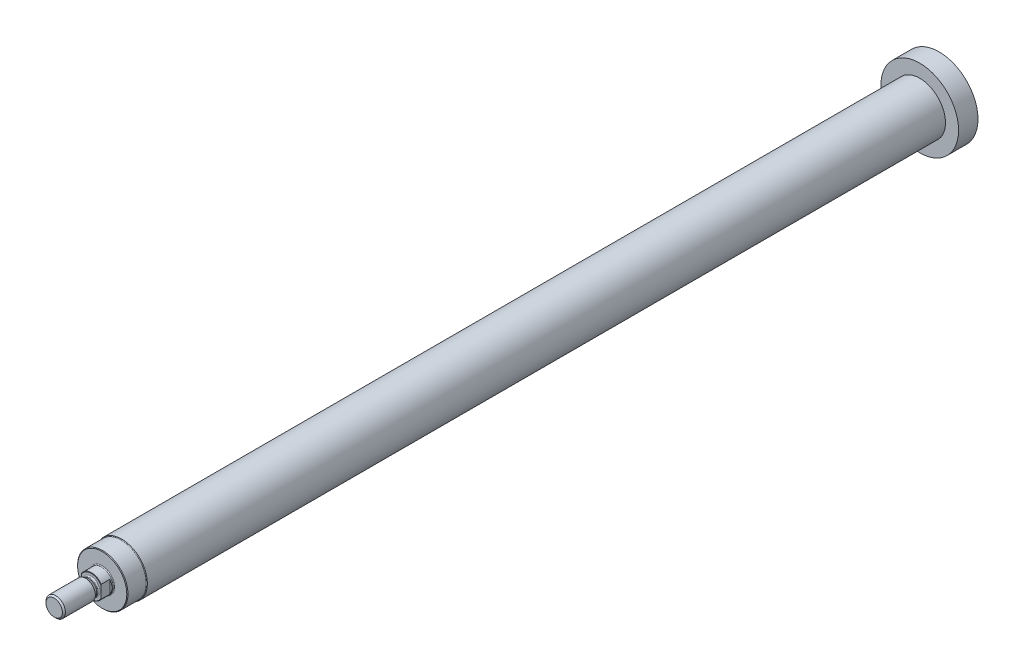
ISO-10303-21;
HEADER;
FILE_DESCRIPTION(('STEP AP214'),'2;1');
FILE_NAME('part.step','',(''),(''),'','','');
FILE_SCHEMA(('AUTOMOTIVE_DESIGN { 1 0 10303 214 1 1 1 1 }'));
ENDSEC;
DATA;
#1=APPLICATION_CONTEXT('core data for automotive mechanical design processes');
#2=APPLICATION_PROTOCOL_DEFINITION('international standard','automotive_design',2000,#1);
#3=PRODUCT_CONTEXT('',#1,'mechanical');
#4=PRODUCT('Part','Part','',(#3));
#5=PRODUCT_RELATED_PRODUCT_CATEGORY('part','',(#4));
#6=PRODUCT_DEFINITION_FORMATION('','',#4);
#7=PRODUCT_DEFINITION_CONTEXT('part definition',#1,'design');
#8=PRODUCT_DEFINITION('design','',#6,#7);
#9=PRODUCT_DEFINITION_SHAPE('','',#8);
#10=(LENGTH_UNIT() NAMED_UNIT(*) SI_UNIT(.MILLI.,.METRE.));
#11=(NAMED_UNIT(*) PLANE_ANGLE_UNIT() SI_UNIT($,.RADIAN.));
#12=(NAMED_UNIT(*) SI_UNIT($,.STERADIAN.) SOLID_ANGLE_UNIT());
#13=UNCERTAINTY_MEASURE_WITH_UNIT(LENGTH_MEASURE(1.E-05),#10,'distance_accuracy_value','');
#14=(GEOMETRIC_REPRESENTATION_CONTEXT(3) GLOBAL_UNCERTAINTY_ASSIGNED_CONTEXT((#13)) GLOBAL_UNIT_ASSIGNED_CONTEXT((#10,
#11,#12)) REPRESENTATION_CONTEXT('',''));
#15=CARTESIAN_POINT('',(0.,0.,0.));
#16=DIRECTION('',(0.,0.,1.));
#17=DIRECTION('',(1.,0.,0.));
#18=AXIS2_PLACEMENT_3D('',#15,#16,#17);
#19=CARTESIAN_POINT('',(0.,0.,21.3));
#20=DIRECTION('',(0.,0.,-1.));
#21=DIRECTION('',(-1.,0.,0.));
#22=AXIS2_PLACEMENT_3D('',#19,#20,#21);
#23=CONICAL_SURFACE('',#22,6.,0.785398163397366);
#24=CARTESIAN_POINT('',(0.,0.,21.3));
#25=DIRECTION('',(0.,0.,1.));
#26=DIRECTION('',(1.,0.,0.));
#27=AXIS2_PLACEMENT_3D('',#24,#25,#26);
#28=CIRCLE('',#27,6.);
#29=CARTESIAN_POINT('',(-5.,-3.3166247903554,21.3));
#30=VERTEX_POINT('',#29);
#31=CARTESIAN_POINT('',(5.,-3.3166247903554,21.3));
#32=VERTEX_POINT('',#31);
#33=EDGE_CURVE('E112',#30,#32,#28,.T.);
#34=ORIENTED_EDGE('',*,*,#33,.T.);
#35=CARTESIAN_POINT('',(5.,-12.2176789778879,14.0988000694348));
#36=CARTESIAN_POINT('',(5.,-12.034446447219,14.2683783577826));
#37=CARTESIAN_POINT('',(5.,-11.8509444650715,14.4376653764507));
#38=CARTESIAN_POINT('',(5.,-11.4833207545759,14.7755677293479));
#39=CARTESIAN_POINT('',(5.,-11.2991990217317,14.9441830586849));
#40=CARTESIAN_POINT('',(5.,-10.7457075833017,15.4489564643171));
#41=CARTESIAN_POINT('',(5.,-10.3752903859568,15.7839689371153));
#42=CARTESIAN_POINT('',(5.,-9.62858519125396,16.4518848263318));
#43=CARTESIAN_POINT('',(5.,-9.25227539434227,16.7847639083574));
#44=CARTESIAN_POINT('',(5.,-8.49470887355593,17.4447807567819));
#45=CARTESIAN_POINT('',(5.,-8.11345273493188,17.7719191918302));
#46=CARTESIAN_POINT('',(5.,-7.4205108180265,18.3537134313858));
#47=CARTESIAN_POINT('',(5.,-7.11006745508805,18.609846141451));
#48=CARTESIAN_POINT('',(5.,-6.48316002759758,19.114851393266));
#49=CARTESIAN_POINT('',(5.,-6.1666945388632,19.3637221814742));
#50=CARTESIAN_POINT('',(5.,-5.68610814885769,19.7289297443601));
#51=CARTESIAN_POINT('',(5.,-5.52501848317731,19.8492540406784));
#52=CARTESIAN_POINT('',(5.,-5.20045993673684,20.0866439636895));
#53=CARTESIAN_POINT('',(5.,-5.03699116742269,20.2037097422799));
#54=CARTESIAN_POINT('',(5.,-4.70731024174682,20.4337901252276));
#55=CARTESIAN_POINT('',(5.,-4.54109914963132,20.5468062495763));
#56=CARTESIAN_POINT('',(5.,-4.2053875486269,20.7678247468052));
#57=CARTESIAN_POINT('',(5.,-4.03588740968757,20.875827678983));
#58=CARTESIAN_POINT('',(5.,-3.69688196972469,21.083139411841));
#59=CARTESIAN_POINT('',(5.,-3.52746365424009,21.1825896827201));
#60=CARTESIAN_POINT('',(5.,-3.18429998418683,21.3738323133674));
#61=CARTESIAN_POINT('',(5.,-3.01055414798465,21.4656238157593));
#62=CARTESIAN_POINT('',(5.,-2.65829713178236,21.6393392193541));
#63=CARTESIAN_POINT('',(5.,-2.47978919748001,21.7212696417427));
#64=CARTESIAN_POINT('',(5.,-2.11750607525661,21.8725900809528));
#65=CARTESIAN_POINT('',(5.,-1.93373240265892,21.9419836643365));
#66=CARTESIAN_POINT('',(5.,-1.60179616287259,22.0514869260315));
#67=CARTESIAN_POINT('',(5.,-1.45465708540571,22.0946813849924));
#68=CARTESIAN_POINT('',(5.,-1.15750269842358,22.1697790194493));
#69=CARTESIAN_POINT('',(5.,-1.00748775290728,22.2016836140871));
#70=CARTESIAN_POINT('',(5.,-0.705757602496844,22.2526173317558));
#71=CARTESIAN_POINT('',(5.,-0.55404950239028,22.2716879366129));
#72=CARTESIAN_POINT('',(5.,-0.249521649238425,22.2960776864431));
#73=CARTESIAN_POINT('',(5.,-0.0967019582817359,22.3013975936443));
#74=CARTESIAN_POINT('',(5.,0.20917014680985,22.2979699797098));
#75=CARTESIAN_POINT('',(5.,0.362222149337708,22.2891862613037));
#76=CARTESIAN_POINT('',(5.,0.666920567730654,22.2579964853449));
#77=CARTESIAN_POINT('',(5.,0.818566870195592,22.2355893383119));
#78=CARTESIAN_POINT('',(5.,1.11992867397053,22.1782551235326));
#79=CARTESIAN_POINT('',(5.,1.26963669057649,22.1432892788203));
#80=CARTESIAN_POINT('',(5.,1.56603832051543,22.0624309113934));
#81=CARTESIAN_POINT('',(5.,1.71273180793289,22.0165379332612));
#82=CARTESIAN_POINT('',(5.,2.02036959338373,21.9093919078484));
#83=CARTESIAN_POINT('',(5.,2.18089769494565,21.8469536603318));
#84=CARTESIAN_POINT('',(5.,2.49794568206284,21.7125945673072));
#85=CARTESIAN_POINT('',(5.,2.65446432060577,21.6406708133978));
#86=CARTESIAN_POINT('',(5.,2.96400159958616,21.489056337277));
#87=CARTESIAN_POINT('',(5.,3.11701369544362,21.4093523541589));
#88=CARTESIAN_POINT('',(5.,3.41961980490705,21.2437828891095));
#89=CARTESIAN_POINT('',(5.,3.56921425448607,21.1579181989224));
#90=CARTESIAN_POINT('',(5.,3.86725925691391,20.9800941592023));
#91=CARTESIAN_POINT('',(5.,4.01567224290916,20.8880721285641));
#92=CARTESIAN_POINT('',(5.,4.30982445825237,20.6998605752006));
#93=CARTESIAN_POINT('',(5.,4.45556362577139,20.6036709562771));
#94=CARTESIAN_POINT('',(5.,4.88902870485944,20.310207181645));
#95=CARTESIAN_POINT('',(5.,5.17331083288786,20.1078496520423));
#96=CARTESIAN_POINT('',(5.,5.76162422896416,19.6741713699587));
#97=CARTESIAN_POINT('',(5.,6.06496587838009,19.441925426966));
#98=CARTESIAN_POINT('',(5.,6.66554264604083,18.9696266158592));
#99=CARTESIAN_POINT('',(5.,6.96277697331729,18.7295727467987));
#100=CARTESIAN_POINT('',(5.,7.55286026279438,18.2436372892536));
#101=CARTESIAN_POINT('',(5.,7.84570516434772,17.9977507898446));
#102=CARTESIAN_POINT('',(5.,8.42782440944073,17.5017841690976));
#103=CARTESIAN_POINT('',(5.,8.71709867293365,17.2517039540401));
#104=CARTESIAN_POINT('',(5.,9.27681202580929,16.7623601060657));
#105=CARTESIAN_POINT('',(5.,9.54740287839069,16.523269715136));
#106=CARTESIAN_POINT('',(5.,10.0865732582408,16.0428241642439));
#107=CARTESIAN_POINT('',(5.,10.3551527483599,15.8014689626352));
#108=CARTESIAN_POINT('',(5.,10.8901673773251,15.3173976040613));
#109=CARTESIAN_POINT('',(5.,11.1566055879447,15.0746848381281));
#110=CARTESIAN_POINT('',(5.,11.6881046905937,14.5877774388495));
#111=CARTESIAN_POINT('',(5.,11.9531656393767,14.3435828674791));
#112=CARTESIAN_POINT('',(5.,12.2176789778879,14.0988000694348));
#113=B_SPLINE_CURVE_WITH_KNOTS('',3,(#35,#36,#37,#38,#39,#40,#41,#42,#43,#44,#45,#46,#47,#48,
#49,#50,#51,#52,#53,#54,#55,#56,#57,#58,#59,#60,#61,#62,#63,#64,#65,#66,#67,#68,#69,#70,#71,#72,
#73,#74,#75,#76,#77,#78,#79,#80,#81,#82,#83,#84,#85,#86,#87,#88,#89,#90,#91,#92,#93,#94,#95,#96,
#97,#98,#99,#100,#101,#102,#103,#104,#105,#106,#107,#108,#109,#110,#111,#112),.UNSPECIFIED.,.F.,
.F.,(4,2,2,2,2,2,2,2,2,2,2,2,2,2,2,2,2,2,2,2,2,2,2,2,2,2,2,2,2,2,2,2,2,2,2,2,2,2,4),(0.,
0.748984328817224,1.49797410282567,2.9962758229022,4.50347404718252,6.01049553748492,
7.21782542751728,8.42544447951652,9.02861334938031,9.63175405496262,10.234665955304,
10.8375104292004,11.4267074421697,12.0159703257382,12.6048413601771,13.1935446040162,
13.6532123605347,14.1128223160341,14.5709394993219,15.0290312877301,15.4883006594101,
15.9476067641883,16.4083434158465,16.8690992733096,17.3854502138647,17.9019598452038,
18.4193657391731,18.9367052573438,19.4605002846108,19.9843074088003,21.0308380209063,
22.1767933392447,23.3228961482106,24.4700008351683,25.6171311914431,26.7003761988933,
27.7836411646704,28.8648794437871,29.946072808613),.UNSPECIFIED.);
#114=CARTESIAN_POINT('',(5.,-2.93938769133981,21.5));
#115=VERTEX_POINT('',#114);
#116=EDGE_CURVE('E165',#32,#115,#113,.T.);
#117=ORIENTED_EDGE('',*,*,#116,.T.);
#118=CARTESIAN_POINT('',(0.,0.,21.5));
#119=DIRECTION('',(0.,0.,1.));
#120=DIRECTION('',(1.,0.,0.));
#121=AXIS2_PLACEMENT_3D('',#118,#119,#120);
#122=CIRCLE('',#121,5.8);
#123=CARTESIAN_POINT('',(-5.,-2.93938769133981,21.5));
#124=VERTEX_POINT('',#123);
#125=EDGE_CURVE('E113',#124,#115,#122,.T.);
#126=ORIENTED_EDGE('',*,*,#125,.F.);
#127=CARTESIAN_POINT('',(-5.,12.2176789778879,14.0988000694348));
#128=CARTESIAN_POINT('',(-5.,12.034446447219,14.2683783577826));
#129=CARTESIAN_POINT('',(-5.,11.8509444650715,14.4376653764507));
#130=CARTESIAN_POINT('',(-5.,11.4833207545759,14.7755677293479));
#131=CARTESIAN_POINT('',(-5.,11.2991990217317,14.9441830586849));
#132=CARTESIAN_POINT('',(-5.,10.7457075833017,15.448956464317));
#133=CARTESIAN_POINT('',(-5.,10.3752903859568,15.7839689371153));
#134=CARTESIAN_POINT('',(-5.,9.62858519125396,16.4518848263318));
#135=CARTESIAN_POINT('',(-5.,9.25227539434227,16.7847639083574));
#136=CARTESIAN_POINT('',(-5.,8.49470887355593,17.4447807567819));
#137=CARTESIAN_POINT('',(-5.,8.11345273493188,17.7719191918302));
#138=CARTESIAN_POINT('',(-5.,7.4205108180265,18.3537134313858));
#139=CARTESIAN_POINT('',(-5.,7.11006745508806,18.609846141451));
#140=CARTESIAN_POINT('',(-5.,6.48316002759758,19.114851393266));
#141=CARTESIAN_POINT('',(-5.,6.16669453886321,19.3637221814742));
#142=CARTESIAN_POINT('',(-5.,5.68610814885769,19.7289297443601));
#143=CARTESIAN_POINT('',(-5.,5.52501848317732,19.8492540406784));
#144=CARTESIAN_POINT('',(-5.,5.20045993673684,20.0866439636895));
#145=CARTESIAN_POINT('',(-5.,5.03699116742269,20.2037097422799));
#146=CARTESIAN_POINT('',(-5.,4.70731024174682,20.4337901252276));
#147=CARTESIAN_POINT('',(-5.,4.54109914963132,20.5468062495763));
#148=CARTESIAN_POINT('',(-5.,4.2053875486269,20.7678247468052));
#149=CARTESIAN_POINT('',(-5.,4.03588740968757,20.875827678983));
#150=CARTESIAN_POINT('',(-5.,3.69688196972469,21.083139411841));
#151=CARTESIAN_POINT('',(-5.,3.52746365424009,21.1825896827201));
#152=CARTESIAN_POINT('',(-5.,3.18429998418683,21.3738323133674));
#153=CARTESIAN_POINT('',(-5.,3.01055414798464,21.4656238157593));
#154=CARTESIAN_POINT('',(-5.,2.65829713178236,21.6393392193541));
#155=CARTESIAN_POINT('',(-5.,2.47978919748001,21.7212696417427));
#156=CARTESIAN_POINT('',(-5.,2.11750607525661,21.8725900809528));
#157=CARTESIAN_POINT('',(-5.,1.93373240265892,21.9419836643365));
#158=CARTESIAN_POINT('',(-5.,1.60179616287259,22.0514869260315));
#159=CARTESIAN_POINT('',(-5.,1.45465708540571,22.0946813849924));
#160=CARTESIAN_POINT('',(-5.,1.15750269842358,22.1697790194493));
#161=CARTESIAN_POINT('',(-5.,1.00748775290727,22.2016836140871));
#162=CARTESIAN_POINT('',(-5.,0.705757602496841,22.2526173317558));
#163=CARTESIAN_POINT('',(-5.,0.554049502390278,22.2716879366129));
#164=CARTESIAN_POINT('',(-5.,0.249521649238424,22.2960776864431));
#165=CARTESIAN_POINT('',(-5.,0.0967019582817342,22.3013975936443));
#166=CARTESIAN_POINT('',(-5.,-0.209170146809852,22.2979699797098));
#167=CARTESIAN_POINT('',(-5.,-0.362222149337709,22.2891862613037));
#168=CARTESIAN_POINT('',(-5.,-0.666920567730654,22.2579964853449));
#169=CARTESIAN_POINT('',(-5.,-0.818566870195593,22.2355893383119));
#170=CARTESIAN_POINT('',(-5.,-1.11992867397053,22.1782551235326));
#171=CARTESIAN_POINT('',(-5.,-1.26963669057649,22.1432892788203));
#172=CARTESIAN_POINT('',(-5.,-1.56603832051543,22.0624309113934));
#173=CARTESIAN_POINT('',(-5.,-1.71273180793289,22.0165379332612));
#174=CARTESIAN_POINT('',(-5.,-2.02036959338373,21.9093919078484));
#175=CARTESIAN_POINT('',(-5.,-2.18089769494565,21.8469536603318));
#176=CARTESIAN_POINT('',(-5.,-2.49794568206284,21.7125945673072));
#177=CARTESIAN_POINT('',(-5.,-2.65446432060577,21.6406708133978));
#178=CARTESIAN_POINT('',(-5.,-2.96400159958616,21.489056337277));
#179=CARTESIAN_POINT('',(-5.,-3.11701369544362,21.4093523541589));
#180=CARTESIAN_POINT('',(-5.,-3.41961980490704,21.2437828891095));
#181=CARTESIAN_POINT('',(-5.,-3.56921425448607,21.1579181989224));
#182=CARTESIAN_POINT('',(-5.,-3.86725925691391,20.9800941592023));
#183=CARTESIAN_POINT('',(-5.,-4.01567224290916,20.8880721285641));
#184=CARTESIAN_POINT('',(-5.,-4.30982445825236,20.6998605752006));
#185=CARTESIAN_POINT('',(-5.,-4.45556362577139,20.6036709562771));
#186=CARTESIAN_POINT('',(-5.,-4.88902870485943,20.310207181645));
#187=CARTESIAN_POINT('',(-5.,-5.17331083288785,20.1078496520423));
#188=CARTESIAN_POINT('',(-5.,-5.76162422896415,19.6741713699587));
#189=CARTESIAN_POINT('',(-5.,-6.06496587838009,19.441925426966));
#190=CARTESIAN_POINT('',(-5.,-6.66554264604083,18.9696266158592));
#191=CARTESIAN_POINT('',(-5.,-6.96277697331728,18.7295727467988));
#192=CARTESIAN_POINT('',(-5.,-7.55286026279438,18.2436372892536));
#193=CARTESIAN_POINT('',(-5.,-7.84570516434772,17.9977507898446));
#194=CARTESIAN_POINT('',(-5.,-8.42782440944073,17.5017841690976));
#195=CARTESIAN_POINT('',(-5.,-8.71709867293365,17.2517039540401));
#196=CARTESIAN_POINT('',(-5.,-9.27681202580928,16.7623601060657));
#197=CARTESIAN_POINT('',(-5.,-9.54740287839069,16.523269715136));
#198=CARTESIAN_POINT('',(-5.,-10.0865732582408,16.0428241642439));
#199=CARTESIAN_POINT('',(-5.,-10.3551527483599,15.8014689626352));
#200=CARTESIAN_POINT('',(-5.,-10.8901673773251,15.3173976040613));
#201=CARTESIAN_POINT('',(-5.,-11.1566055879447,15.0746848381282));
#202=CARTESIAN_POINT('',(-5.,-11.6881046905937,14.5877774388495));
#203=CARTESIAN_POINT('',(-5.,-11.9531656393767,14.3435828674791));
#204=CARTESIAN_POINT('',(-5.,-12.2176789778879,14.0988000694348));
#205=B_SPLINE_CURVE_WITH_KNOTS('',3,(#127,#128,#129,#130,#131,#132,#133,#134,#135,#136,#137,
#138,#139,#140,#141,#142,#143,#144,#145,#146,#147,#148,#149,#150,#151,#152,#153,#154,#155,#156,
#157,#158,#159,#160,#161,#162,#163,#164,#165,#166,#167,#168,#169,#170,#171,#172,#173,#174,#175,
#176,#177,#178,#179,#180,#181,#182,#183,#184,#185,#186,#187,#188,#189,#190,#191,#192,#193,#194,
#195,#196,#197,#198,#199,#200,#201,#202,#203,#204),.UNSPECIFIED.,.F.,.F.,(4,2,2,2,2,2,2,2,2,2,2,
2,2,2,2,2,2,2,2,2,2,2,2,2,2,2,2,2,2,2,2,2,2,2,2,2,2,2,4),(0.,0.748984328817225,1.49797410282567,
2.9962758229022,4.50347404718253,6.01049553748492,7.21782542751727,8.42544447951651,
9.02861334938031,9.63175405496262,10.234665955304,10.8375104292004,11.4267074421697,
12.0159703257382,12.6048413601771,13.1935446040162,13.6532123605347,14.1128223160341,
14.5709394993219,15.0290312877301,15.4883006594101,15.9476067641883,16.4083434158465,
16.8690992733096,17.3854502138647,17.9019598452038,18.4193657391731,18.9367052573438,
19.4605002846108,19.9843074088002,21.0308380209062,22.1767933392447,23.3228961482106,
24.4700008351683,25.6171311914431,26.7003761988933,27.7836411646704,28.8648794437871,
29.946072808613),.UNSPECIFIED.);
#206=EDGE_CURVE('E54',#124,#30,#205,.T.);
#207=ORIENTED_EDGE('',*,*,#206,.T.);
#208=EDGE_LOOP('',(#34,#117,#126,#207));
#209=FACE_BOUND('',#208,.T.);
#210=ADVANCED_FACE('F39',(#209),#23,.T.);
#211=CARTESIAN_POINT('',(0.,20.,-415.));
#212=DIRECTION('',(0.,0.,1.));
#213=DIRECTION('',(1.,0.,0.));
#214=AXIS2_PLACEMENT_3D('',#211,#212,#213);
#215=PLANE('',#214);
#216=CARTESIAN_POINT('',(0.,0.,-415.));
#217=DIRECTION('',(0.,0.,1.));
#218=DIRECTION('',(1.,0.,0.));
#219=AXIS2_PLACEMENT_3D('',#216,#217,#218);
#220=CIRCLE('',#219,20.);
#221=CARTESIAN_POINT('',(20.,0.,-415.));
#222=VERTEX_POINT('',#221);
#223=EDGE_CURVE('E145',#222,#222,#220,.T.);
#224=ORIENTED_EDGE('',*,*,#223,.F.);
#225=EDGE_LOOP('',(#224));
#226=FACE_BOUND('',#225,.T.);
#227=ADVANCED_FACE('F41',(#226),#215,.F.);
#228=CARTESIAN_POINT('',(0.,0.,-415.));
#229=DIRECTION('',(0.,0.,1.));
#230=DIRECTION('',(1.,0.,0.));
#231=AXIS2_PLACEMENT_3D('',#228,#229,#230);
#232=CYLINDRICAL_SURFACE('',#231,20.);
#233=CARTESIAN_POINT('',(0.,0.,-405.));
#234=DIRECTION('',(0.,0.,1.));
#235=DIRECTION('',(1.,0.,0.));
#236=AXIS2_PLACEMENT_3D('',#233,#234,#235);
#237=CIRCLE('',#236,20.);
#238=CARTESIAN_POINT('',(20.,0.,-405.));
#239=VERTEX_POINT('',#238);
#240=EDGE_CURVE('E142',#239,#239,#237,.T.);
#241=ORIENTED_EDGE('',*,*,#240,.F.);
#242=EDGE_LOOP('',(#241));
#243=FACE_BOUND('',#242,.T.);
#244=ORIENTED_EDGE('',*,*,#223,.T.);
#245=EDGE_LOOP('',(#244));
#246=FACE_BOUND('',#245,.T.);
#247=ADVANCED_FACE('F214',(#243,#246),#232,.T.);
#248=CARTESIAN_POINT('',(0.,13.26,-405.));
#249=DIRECTION('',(0.,0.,-1.));
#250=DIRECTION('',(-1.,0.,0.));
#251=AXIS2_PLACEMENT_3D('',#248,#249,#250);
#252=PLANE('',#251);
#253=CARTESIAN_POINT('',(0.,0.,-405.));
#254=DIRECTION('',(0.,0.,1.));
#255=DIRECTION('',(1.,0.,0.));
#256=AXIS2_PLACEMENT_3D('',#253,#254,#255);
#257=CIRCLE('',#256,13.26);
#258=CARTESIAN_POINT('',(13.26,0.,-405.));
#259=VERTEX_POINT('',#258);
#260=EDGE_CURVE('E139',#259,#259,#257,.T.);
#261=ORIENTED_EDGE('',*,*,#260,.F.);
#262=EDGE_LOOP('',(#261));
#263=FACE_BOUND('',#262,.T.);
#264=ORIENTED_EDGE('',*,*,#240,.T.);
#265=EDGE_LOOP('',(#264));
#266=FACE_BOUND('',#265,.T.);
#267=ADVANCED_FACE('F311',(#263,#266),#252,.F.);
#268=CARTESIAN_POINT('',(0.,0.,-415.));
#269=DIRECTION('',(0.,0.,1.));
#270=DIRECTION('',(1.,0.,0.));
#271=AXIS2_PLACEMENT_3D('',#268,#269,#270);
#272=CYLINDRICAL_SURFACE('',#271,13.2599999999999);
#273=CARTESIAN_POINT('',(0.,0.,5.80000000000003));
#274=DIRECTION('',(0.,0.,1.));
#275=DIRECTION('',(1.,0.,0.));
#276=AXIS2_PLACEMENT_3D('',#273,#274,#275);
#277=CIRCLE('',#276,13.2599999999999);
#278=CARTESIAN_POINT('',(13.2599999999999,0.,5.80000000000003));
#279=VERTEX_POINT('',#278);
#280=EDGE_CURVE('E136',#279,#279,#277,.T.);
#281=ORIENTED_EDGE('',*,*,#280,.F.);
#282=EDGE_LOOP('',(#281));
#283=FACE_BOUND('',#282,.T.);
#284=ORIENTED_EDGE('',*,*,#260,.T.);
#285=EDGE_LOOP('',(#284));
#286=FACE_BOUND('',#285,.T.);
#287=ADVANCED_FACE('F341',(#283,#286),#272,.T.);
#288=CARTESIAN_POINT('',(0.,0.,6.09999999999988));
#289=DIRECTION('',(0.,0.,1.));
#290=DIRECTION('',(1.,0.,0.));
#291=AXIS2_PLACEMENT_3D('',#288,#289,#290);
#292=TOROIDAL_SURFACE('',#291,13.2599999999999,0.299999999999878);
#293=CARTESIAN_POINT('',(0.,0.,6.09999999999999));
#294=DIRECTION('',(0.,0.,1.));
#295=DIRECTION('',(1.,0.,0.));
#296=AXIS2_PLACEMENT_3D('',#293,#294,#295);
#297=CIRCLE('',#296,12.96);
#298=CARTESIAN_POINT('',(12.96,0.,6.09999999999999));
#299=VERTEX_POINT('',#298);
#300=EDGE_CURVE('E133',#299,#299,#297,.T.);
#301=ORIENTED_EDGE('',*,*,#300,.F.);
#302=EDGE_LOOP('',(#301));
#303=FACE_BOUND('',#302,.T.);
#304=ORIENTED_EDGE('',*,*,#280,.T.);
#305=EDGE_LOOP('',(#304));
#306=FACE_BOUND('',#305,.T.);
#307=ADVANCED_FACE('F346',(#303,#306),#292,.F.);
#308=CARTESIAN_POINT('',(0.,0.,-415.));
#309=DIRECTION('',(0.,0.,1.));
#310=DIRECTION('',(1.,0.,0.));
#311=AXIS2_PLACEMENT_3D('',#308,#309,#310);
#312=CYLINDRICAL_SURFACE('',#311,12.96);
#313=CARTESIAN_POINT('',(0.,0.,15.5));
#314=DIRECTION('',(0.,0.,1.));
#315=DIRECTION('',(1.,0.,0.));
#316=AXIS2_PLACEMENT_3D('',#313,#314,#315);
#317=CIRCLE('',#316,12.96);
#318=CARTESIAN_POINT('',(12.96,0.,15.5));
#319=VERTEX_POINT('',#318);
#320=EDGE_CURVE('E130',#319,#319,#317,.T.);
#321=ORIENTED_EDGE('',*,*,#320,.F.);
#322=EDGE_LOOP('',(#321));
#323=FACE_BOUND('',#322,.T.);
#324=ORIENTED_EDGE('',*,*,#300,.T.);
#325=EDGE_LOOP('',(#324));
#326=FACE_BOUND('',#325,.T.);
#327=ADVANCED_FACE('F331',(#323,#326),#312,.T.);
#328=CARTESIAN_POINT('',(0.,0.,15.5));
#329=DIRECTION('',(0.,0.,-1.));
#330=DIRECTION('',(-1.,0.,0.));
#331=AXIS2_PLACEMENT_3D('',#328,#329,#330);
#332=CONICAL_SURFACE('',#331,12.96,0.785398163397503);
#333=CARTESIAN_POINT('',(0.,0.,15.8));
#334=DIRECTION('',(0.,0.,1.));
#335=DIRECTION('',(1.,0.,0.));
#336=AXIS2_PLACEMENT_3D('',#333,#334,#335);
#337=CIRCLE('',#336,12.66);
#338=CARTESIAN_POINT('',(12.66,0.,15.8));
#339=VERTEX_POINT('',#338);
#340=EDGE_CURVE('E127',#339,#339,#337,.T.);
#341=ORIENTED_EDGE('',*,*,#340,.F.);
#342=EDGE_LOOP('',(#341));
#343=FACE_BOUND('',#342,.T.);
#344=ORIENTED_EDGE('',*,*,#320,.T.);
#345=EDGE_LOOP('',(#344));
#346=FACE_BOUND('',#345,.T.);
#347=ADVANCED_FACE('F325',(#343,#346),#332,.T.);
#348=CARTESIAN_POINT('',(0.,6.4,15.8));
#349=DIRECTION('',(0.,0.,-1.));
#350=DIRECTION('',(-1.,0.,0.));
#351=AXIS2_PLACEMENT_3D('',#348,#349,#350);
#352=PLANE('',#351);
#353=CARTESIAN_POINT('',(0.,0.,15.8));
#354=DIRECTION('',(0.,0.,1.));
#355=DIRECTION('',(1.,0.,0.));
#356=AXIS2_PLACEMENT_3D('',#353,#354,#355);
#357=CIRCLE('',#356,6.39999999999938);
#358=CARTESIAN_POINT('',(6.39999999999938,0.,15.8));
#359=VERTEX_POINT('',#358);
#360=EDGE_CURVE('E124',#359,#359,#357,.T.);
#361=ORIENTED_EDGE('',*,*,#360,.F.);
#362=EDGE_LOOP('',(#361));
#363=FACE_BOUND('',#362,.T.);
#364=ORIENTED_EDGE('',*,*,#340,.T.);
#365=EDGE_LOOP('',(#364));
#366=FACE_BOUND('',#365,.T.);
#367=ADVANCED_FACE('F330',(#363,#366),#352,.F.);
#368=CARTESIAN_POINT('',(0.,0.,16.1999999999994));
#369=DIRECTION('',(0.,0.,1.));
#370=DIRECTION('',(1.,0.,0.));
#371=AXIS2_PLACEMENT_3D('',#368,#369,#370);
#372=TOROIDAL_SURFACE('',#371,6.39999999999938,0.399999999999381);
#373=CARTESIAN_POINT('',(0.,0.,16.2));
#374=DIRECTION('',(0.,0.,1.));
#375=DIRECTION('',(1.,0.,0.));
#376=AXIS2_PLACEMENT_3D('',#373,#374,#375);
#377=CIRCLE('',#376,6.);
#378=CARTESIAN_POINT('',(6.,0.,16.2));
#379=VERTEX_POINT('',#378);
#380=EDGE_CURVE('E121',#379,#379,#377,.T.);
#381=ORIENTED_EDGE('',*,*,#380,.F.);
#382=EDGE_LOOP('',(#381));
#383=FACE_BOUND('',#382,.T.);
#384=ORIENTED_EDGE('',*,*,#360,.T.);
#385=EDGE_LOOP('',(#384));
#386=FACE_BOUND('',#385,.T.);
#387=ADVANCED_FACE('F379',(#383,#386),#372,.F.);
#388=CARTESIAN_POINT('',(0.,0.,-415.));
#389=DIRECTION('',(0.,0.,1.));
#390=DIRECTION('',(1.,0.,0.));
#391=AXIS2_PLACEMENT_3D('',#388,#389,#390);
#392=CYLINDRICAL_SURFACE('',#391,6.);
#393=DIRECTION('',(0.,0.,1.));
#394=VECTOR('',#393,1.);
#395=CARTESIAN_POINT('',(-5.,3.3166247903554,-415.));
#396=LINE('',#395,#394);
#397=CARTESIAN_POINT('',(-5.,3.3166247903554,16.8));
#398=VERTEX_POINT('',#397);
#399=CARTESIAN_POINT('',(-5.,3.3166247903554,21.3));
#400=VERTEX_POINT('',#399);
#401=EDGE_CURVE('E108',#398,#400,#396,.T.);
#402=ORIENTED_EDGE('',*,*,#401,.T.);
#403=CARTESIAN_POINT('',(5.,3.3166247903554,21.3));
#404=VERTEX_POINT('',#403);
#405=EDGE_CURVE('E107',#404,#400,#28,.T.);
#406=ORIENTED_EDGE('',*,*,#405,.F.);
#407=DIRECTION('',(0.,0.,1.));
#408=VECTOR('',#407,1.);
#409=CARTESIAN_POINT('',(5.,3.3166247903554,-415.));
#410=LINE('',#409,#408);
#411=CARTESIAN_POINT('',(5.,3.3166247903554,16.8));
#412=VERTEX_POINT('',#411);
#413=EDGE_CURVE('E159',#404,#412,#410,.F.);
#414=ORIENTED_EDGE('',*,*,#413,.T.);
#415=CARTESIAN_POINT('',(0.,0.,16.8));
#416=DIRECTION('',(0.,0.,1.));
#417=DIRECTION('',(1.,0.,0.));
#418=AXIS2_PLACEMENT_3D('',#415,#416,#417);
#419=CIRCLE('',#418,6.);
#420=CARTESIAN_POINT('',(5.,-3.3166247903554,16.8));
#421=VERTEX_POINT('',#420);
#422=EDGE_CURVE('E43',#421,#412,#419,.T.);
#423=ORIENTED_EDGE('',*,*,#422,.F.);
#424=DIRECTION('',(0.,0.,1.));
#425=VECTOR('',#424,1.);
#426=CARTESIAN_POINT('',(5.,-3.3166247903554,-415.));
#427=LINE('',#426,#425);
#428=EDGE_CURVE('E160',#421,#32,#427,.T.);
#429=ORIENTED_EDGE('',*,*,#428,.T.);
#430=ORIENTED_EDGE('',*,*,#33,.F.);
#431=DIRECTION('',(0.,0.,1.));
#432=VECTOR('',#431,1.);
#433=CARTESIAN_POINT('',(-5.,-3.3166247903554,-415.));
#434=LINE('',#433,#432);
#435=CARTESIAN_POINT('',(-5.,-3.3166247903554,16.8));
#436=VERTEX_POINT('',#435);
#437=EDGE_CURVE('E109',#30,#436,#434,.F.);
#438=ORIENTED_EDGE('',*,*,#437,.T.);
#439=EDGE_CURVE('E11',#398,#436,#419,.T.);
#440=ORIENTED_EDGE('',*,*,#439,.F.);
#441=EDGE_LOOP('',(#402,#406,#414,#423,#429,#430,#438,#440));
#442=FACE_BOUND('',#441,.T.);
#443=ORIENTED_EDGE('',*,*,#380,.T.);
#444=EDGE_LOOP('',(#443));
#445=FACE_BOUND('',#444,.T.);
#446=ADVANCED_FACE('F163',(#442,#445),#392,.T.);
#447=CARTESIAN_POINT('',(5.,2.93938769133981,21.5));
#448=VERTEX_POINT('',#447);
#449=CARTESIAN_POINT('',(-5.,2.93938769133981,21.5));
#450=VERTEX_POINT('',#449);
#451=EDGE_CURVE('E105',#448,#450,#122,.T.);
#452=ORIENTED_EDGE('',*,*,#451,.F.);
#453=EDGE_CURVE('E62',#448,#404,#113,.T.);
#454=ORIENTED_EDGE('',*,*,#453,.T.);
#455=ORIENTED_EDGE('',*,*,#405,.T.);
#456=EDGE_CURVE('E93',#400,#450,#205,.T.);
#457=ORIENTED_EDGE('',*,*,#456,.T.);
#458=EDGE_LOOP('',(#452,#454,#455,#457));
#459=FACE_BOUND('',#458,.T.);
#460=ADVANCED_FACE('F104',(#459),#23,.T.);
#461=CARTESIAN_POINT('',(0.,0.,21.5));
#462=DIRECTION('',(0.,0.,-1.));
#463=DIRECTION('',(-1.,0.,0.));
#464=AXIS2_PLACEMENT_3D('',#461,#462,#463);
#465=PLANE('',#464);
#466=CARTESIAN_POINT('',(0.,0.,21.5));
#467=DIRECTION('',(0.,0.,1.));
#468=DIRECTION('',(1.,0.,0.));
#469=AXIS2_PLACEMENT_3D('',#466,#467,#468);
#470=CIRCLE('',#469,4.59999999999992);
#471=CARTESIAN_POINT('',(4.59999999999992,0.,21.5));
#472=VERTEX_POINT('',#471);
#473=EDGE_CURVE('E100',#472,#472,#470,.T.);
#474=ORIENTED_EDGE('',*,*,#473,.F.);
#475=EDGE_LOOP('',(#474));
#476=FACE_BOUND('',#475,.T.);
#477=ORIENTED_EDGE('',*,*,#125,.T.);
#478=DIRECTION('',(0.,1.,0.));
#479=VECTOR('',#478,1.);
#480=CARTESIAN_POINT('',(5.,0.,21.5));
#481=LINE('',#480,#479);
#482=EDGE_CURVE('E99',#115,#448,#481,.T.);
#483=ORIENTED_EDGE('',*,*,#482,.T.);
#484=ORIENTED_EDGE('',*,*,#451,.T.);
#485=DIRECTION('',(0.,-1.,0.));
#486=VECTOR('',#485,1.);
#487=CARTESIAN_POINT('',(-5.,0.,21.5));
#488=LINE('',#487,#486);
#489=EDGE_CURVE('E89',#450,#124,#488,.T.);
#490=ORIENTED_EDGE('',*,*,#489,.T.);
#491=EDGE_LOOP('',(#477,#483,#484,#490));
#492=FACE_BOUND('',#491,.T.);
#493=ADVANCED_FACE('F111',(#476,#492),#465,.F.);
#494=CARTESIAN_POINT('',(0.,0.,22.0999999999999));
#495=DIRECTION('',(0.,0.,1.));
#496=DIRECTION('',(1.,0.,0.));
#497=AXIS2_PLACEMENT_3D('',#494,#495,#496);
#498=TOROIDAL_SURFACE('',#497,4.59999999999992,0.599999999999924);
#499=CARTESIAN_POINT('',(0.,0.,22.1));
#500=DIRECTION('',(0.,0.,1.));
#501=DIRECTION('',(1.,0.,0.));
#502=AXIS2_PLACEMENT_3D('',#499,#500,#501);
#503=CIRCLE('',#502,4.);
#504=CARTESIAN_POINT('',(4.,0.,22.1));
#505=VERTEX_POINT('',#504);
#506=EDGE_CURVE('E117',#505,#505,#503,.T.);
#507=ORIENTED_EDGE('',*,*,#506,.F.);
#508=EDGE_LOOP('',(#507));
#509=FACE_BOUND('',#508,.T.);
#510=ORIENTED_EDGE('',*,*,#473,.T.);
#511=EDGE_LOOP('',(#510));
#512=FACE_BOUND('',#511,.T.);
#513=ADVANCED_FACE('F198',(#509,#512),#498,.F.);
#514=CARTESIAN_POINT('',(0.,0.,21.5));
#515=DIRECTION('',(0.,0.,1.));
#516=DIRECTION('',(1.,0.,0.));
#517=AXIS2_PLACEMENT_3D('',#514,#515,#516);
#518=CYLINDRICAL_SURFACE('',#517,3.99999999999991);
#519=CARTESIAN_POINT('',(0.,0.,22.4392304845417));
#520=DIRECTION('',(0.,0.,1.));
#521=DIRECTION('',(1.,0.,0.));
#522=AXIS2_PLACEMENT_3D('',#519,#520,#521);
#523=CIRCLE('',#522,3.99999999999982);
#524=CARTESIAN_POINT('',(3.99999999999982,0.,22.4392304845417));
#525=VERTEX_POINT('',#524);
#526=EDGE_CURVE('E189',#525,#525,#523,.T.);
#527=ORIENTED_EDGE('',*,*,#526,.F.);
#528=EDGE_LOOP('',(#527));
#529=FACE_BOUND('',#528,.T.);
#530=ORIENTED_EDGE('',*,*,#506,.T.);
#531=EDGE_LOOP('',(#530));
#532=FACE_BOUND('',#531,.T.);
#533=ADVANCED_FACE('F196',(#529,#532),#518,.T.);
#534=CARTESIAN_POINT('',(0.,0.,22.4392304845416));
#535=DIRECTION('',(0.,0.,1.));
#536=DIRECTION('',(1.,0.,0.));
#537=AXIS2_PLACEMENT_3D('',#534,#535,#536);
#538=TOROIDAL_SURFACE('',#537,4.599999999998,0.599999999998182);
#539=CARTESIAN_POINT('',(0.,0.,22.7392304845407));
#540=DIRECTION('',(0.,0.,1.));
#541=DIRECTION('',(1.,0.,0.));
#542=AXIS2_PLACEMENT_3D('',#539,#540,#541);
#543=CIRCLE('',#542,4.0803847577289);
#544=CARTESIAN_POINT('',(4.0803847577289,0.,22.7392304845407));
#545=VERTEX_POINT('',#544);
#546=EDGE_CURVE('E187',#545,#545,#543,.T.);
#547=ORIENTED_EDGE('',*,*,#546,.F.);
#548=EDGE_LOOP('',(#547));
#549=FACE_BOUND('',#548,.T.);
#550=ORIENTED_EDGE('',*,*,#526,.T.);
#551=EDGE_LOOP('',(#550));
#552=FACE_BOUND('',#551,.T.);
#553=ADVANCED_FACE('F248',(#549,#552),#538,.F.);
#554=CARTESIAN_POINT('',(0.,0.,22.7392304845407));
#555=DIRECTION('',(0.,0.,1.));
#556=DIRECTION('',(1.,0.,0.));
#557=AXIS2_PLACEMENT_3D('',#554,#555,#556);
#558=CONICAL_SURFACE('',#557,4.0803847577289,0.523598775598299);
#559=CARTESIAN_POINT('',(0.,0.,24.332050807569));
#560=DIRECTION('',(0.,0.,1.));
#561=DIRECTION('',(1.,0.,0.));
#562=AXIS2_PLACEMENT_3D('',#559,#560,#561);
#563=CIRCLE('',#562,5.);
#564=CARTESIAN_POINT('',(5.,0.,24.332050807569));
#565=VERTEX_POINT('',#564);
#566=EDGE_CURVE('E184',#565,#565,#563,.T.);
#567=ORIENTED_EDGE('',*,*,#566,.F.);
#568=EDGE_LOOP('',(#567));
#569=FACE_BOUND('',#568,.T.);
#570=ORIENTED_EDGE('',*,*,#546,.T.);
#571=EDGE_LOOP('',(#570));
#572=FACE_BOUND('',#571,.T.);
#573=ADVANCED_FACE('F244',(#569,#572),#558,.T.);
#574=CARTESIAN_POINT('',(0.,0.,21.5));
#575=DIRECTION('',(0.,0.,1.));
#576=DIRECTION('',(1.,0.,0.));
#577=AXIS2_PLACEMENT_3D('',#574,#575,#576);
#578=CYLINDRICAL_SURFACE('',#577,5.);
#579=CARTESIAN_POINT('',(0.,0.,39.733));
#580=DIRECTION('',(0.,0.,1.));
#581=DIRECTION('',(1.,0.,0.));
#582=AXIS2_PLACEMENT_3D('',#579,#580,#581);
#583=CIRCLE('',#582,5.);
#584=CARTESIAN_POINT('',(5.,0.,39.733));
#585=VERTEX_POINT('',#584);
#586=EDGE_CURVE('E181',#585,#585,#583,.T.);
#587=ORIENTED_EDGE('',*,*,#586,.F.);
#588=EDGE_LOOP('',(#587));
#589=FACE_BOUND('',#588,.T.);
#590=ORIENTED_EDGE('',*,*,#566,.T.);
#591=EDGE_LOOP('',(#590));
#592=FACE_BOUND('',#591,.T.);
#593=ADVANCED_FACE('F240',(#589,#592),#578,.T.);
#594=CARTESIAN_POINT('',(0.,0.,39.733));
#595=DIRECTION('',(0.,0.,-1.));
#596=DIRECTION('',(-1.,0.,0.));
#597=AXIS2_PLACEMENT_3D('',#594,#595,#596);
#598=CONICAL_SURFACE('',#597,5.,0.785398163397446);
#599=CARTESIAN_POINT('',(0.,0.,40.5));
#600=DIRECTION('',(0.,0.,1.));
#601=DIRECTION('',(1.,0.,0.));
#602=AXIS2_PLACEMENT_3D('',#599,#600,#601);
#603=CIRCLE('',#602,4.233);
#604=CARTESIAN_POINT('',(4.233,0.,40.5));
#605=VERTEX_POINT('',#604);
#606=EDGE_CURVE('E178',#605,#605,#603,.T.);
#607=ORIENTED_EDGE('',*,*,#606,.F.);
#608=EDGE_LOOP('',(#607));
#609=FACE_BOUND('',#608,.T.);
#610=ORIENTED_EDGE('',*,*,#586,.T.);
#611=EDGE_LOOP('',(#610));
#612=FACE_BOUND('',#611,.T.);
#613=ADVANCED_FACE('F236',(#609,#612),#598,.T.);
#614=CARTESIAN_POINT('',(0.,0.,40.5));
#615=DIRECTION('',(0.,0.,-1.));
#616=DIRECTION('',(-1.,0.,0.));
#617=AXIS2_PLACEMENT_3D('',#614,#615,#616);
#618=PLANE('',#617);
#619=ORIENTED_EDGE('',*,*,#606,.T.);
#620=EDGE_LOOP('',(#619));
#621=FACE_BOUND('',#620,.T.);
#622=ADVANCED_FACE('F231',(#621),#618,.F.);
#623=CARTESIAN_POINT('',(-5.,-6.,16.8));
#624=DIRECTION('',(1.,0.,0.));
#625=DIRECTION('',(0.,0.,-1.));
#626=AXIS2_PLACEMENT_3D('',#623,#624,#625);
#627=PLANE('',#626);
#628=DIRECTION('',(0.,1.,0.));
#629=VECTOR('',#628,1.);
#630=CARTESIAN_POINT('',(-5.,-6.,16.8));
#631=LINE('',#630,#629);
#632=EDGE_CURVE('E161',#436,#398,#631,.T.);
#633=ORIENTED_EDGE('',*,*,#632,.F.);
#634=ORIENTED_EDGE('',*,*,#437,.F.);
#635=ORIENTED_EDGE('',*,*,#206,.F.);
#636=ORIENTED_EDGE('',*,*,#489,.F.);
#637=ORIENTED_EDGE('',*,*,#456,.F.);
#638=ORIENTED_EDGE('',*,*,#401,.F.);
#639=EDGE_LOOP('',(#633,#634,#635,#636,#637,#638));
#640=FACE_BOUND('',#639,.T.);
#641=ADVANCED_FACE('F92',(#640),#627,.F.);
#642=CARTESIAN_POINT('',(0.,0.,16.8));
#643=DIRECTION('',(0.,0.,1.));
#644=DIRECTION('',(1.,0.,0.));
#645=AXIS2_PLACEMENT_3D('',#642,#643,#644);
#646=PLANE('',#645);
#647=ORIENTED_EDGE('',*,*,#439,.T.);
#648=ORIENTED_EDGE('',*,*,#632,.T.);
#649=EDGE_LOOP('',(#647,#648));
#650=FACE_BOUND('',#649,.T.);
#651=ADVANCED_FACE('F230',(#650),#646,.T.);
#652=ORIENTED_EDGE('',*,*,#422,.T.);
#653=DIRECTION('',(0.,-1.,0.));
#654=VECTOR('',#653,1.);
#655=CARTESIAN_POINT('',(5.,6.,16.8));
#656=LINE('',#655,#654);
#657=EDGE_CURVE('E154',#412,#421,#656,.T.);
#658=ORIENTED_EDGE('',*,*,#657,.T.);
#659=EDGE_LOOP('',(#652,#658));
#660=FACE_BOUND('',#659,.T.);
#661=ADVANCED_FACE('F153',(#660),#646,.T.);
#662=CARTESIAN_POINT('',(5.,6.,16.8));
#663=DIRECTION('',(-1.,0.,0.));
#664=DIRECTION('',(0.,0.,1.));
#665=AXIS2_PLACEMENT_3D('',#662,#663,#664);
#666=PLANE('',#665);
#667=ORIENTED_EDGE('',*,*,#657,.F.);
#668=ORIENTED_EDGE('',*,*,#413,.F.);
#669=ORIENTED_EDGE('',*,*,#453,.F.);
#670=ORIENTED_EDGE('',*,*,#482,.F.);
#671=ORIENTED_EDGE('',*,*,#116,.F.);
#672=ORIENTED_EDGE('',*,*,#428,.F.);
#673=EDGE_LOOP('',(#667,#668,#669,#670,#671,#672));
#674=FACE_BOUND('',#673,.T.);
#675=ADVANCED_FACE('F158',(#674),#666,.F.);
#676=CLOSED_SHELL('',(#210,#227,#247,#267,#287,#307,#327,#347,#367,#387,#446,#460,#493,#513,
#533,#553,#573,#593,#613,#622,#641,#651,#661,#675));
#677=MANIFOLD_SOLID_BREP('B2',#676);
#678=ADVANCED_BREP_SHAPE_REPRESENTATION('',(#18,#677),#14);
#679=SHAPE_DEFINITION_REPRESENTATION(#9,#678);
ENDSEC;
END-ISO-10303-21;
